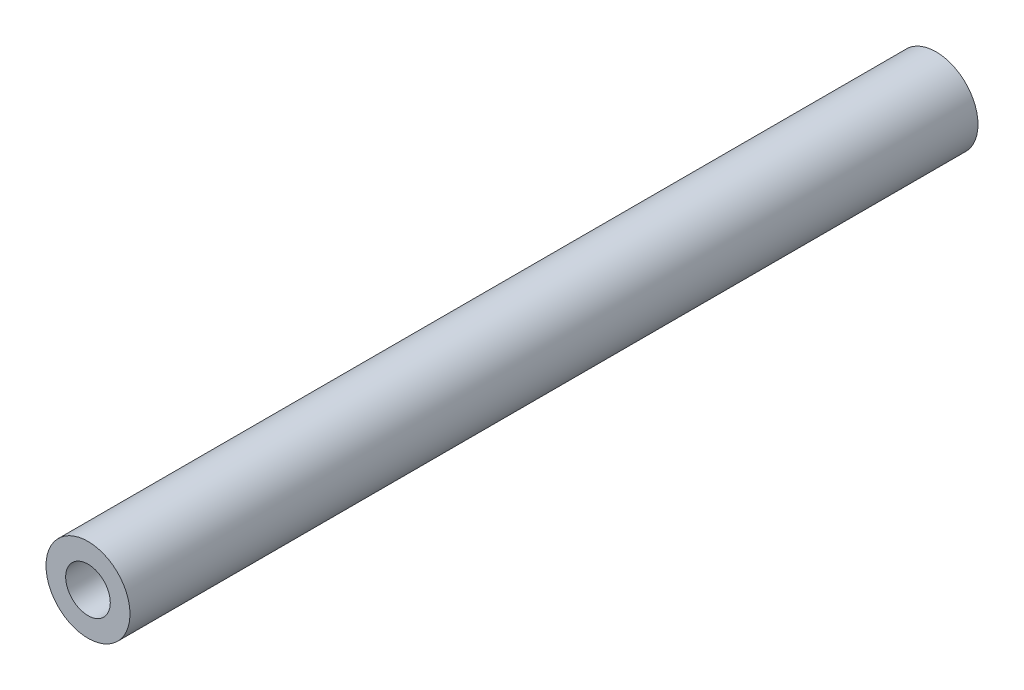
ISO-10303-21;
HEADER;
FILE_DESCRIPTION(('STEP AP214'),'2;1');
FILE_NAME('part.step','',(''),(''),'','','');
FILE_SCHEMA(('AUTOMOTIVE_DESIGN { 1 0 10303 214 1 1 1 1 }'));
ENDSEC;
DATA;
#1=APPLICATION_CONTEXT('core data for automotive mechanical design processes');
#2=APPLICATION_PROTOCOL_DEFINITION('international standard','automotive_design',2000,#1);
#3=PRODUCT_CONTEXT('',#1,'mechanical');
#4=PRODUCT('Part','Part','',(#3));
#5=PRODUCT_RELATED_PRODUCT_CATEGORY('part','',(#4));
#6=PRODUCT_DEFINITION_FORMATION('','',#4);
#7=PRODUCT_DEFINITION_CONTEXT('part definition',#1,'design');
#8=PRODUCT_DEFINITION('design','',#6,#7);
#9=PRODUCT_DEFINITION_SHAPE('','',#8);
#10=(LENGTH_UNIT() NAMED_UNIT(*) SI_UNIT(.MILLI.,.METRE.));
#11=(NAMED_UNIT(*) PLANE_ANGLE_UNIT() SI_UNIT($,.RADIAN.));
#12=(NAMED_UNIT(*) SI_UNIT($,.STERADIAN.) SOLID_ANGLE_UNIT());
#13=UNCERTAINTY_MEASURE_WITH_UNIT(LENGTH_MEASURE(1.E-05),#10,'distance_accuracy_value','');
#14=(GEOMETRIC_REPRESENTATION_CONTEXT(3) GLOBAL_UNCERTAINTY_ASSIGNED_CONTEXT((#13)) GLOBAL_UNIT_ASSIGNED_CONTEXT((#10,
#11,#12)) REPRESENTATION_CONTEXT('',''));
#15=CARTESIAN_POINT('',(0.,0.,0.));
#16=DIRECTION('',(0.,0.,1.));
#17=DIRECTION('',(1.,0.,0.));
#18=AXIS2_PLACEMENT_3D('',#15,#16,#17);
#19=CARTESIAN_POINT('',(99.9999999999999,-317.,0.));
#20=DIRECTION('',(0.,0.,1.));
#21=DIRECTION('',(1.,0.,0.));
#22=AXIS2_PLACEMENT_3D('',#19,#20,#21);
#23=PLANE('',#22);
#24=CARTESIAN_POINT('',(99.9999999999999,-317.,0.));
#25=DIRECTION('',(0.,0.,-1.));
#26=DIRECTION('',(-1.,0.,0.));
#27=AXIS2_PLACEMENT_3D('',#24,#25,#26);
#28=CIRCLE('',#27,4.24999999999999);
#29=CARTESIAN_POINT('',(95.7499999999999,-317.,0.));
#30=VERTEX_POINT('',#29);
#31=EDGE_CURVE('E63',#30,#30,#28,.T.);
#32=ORIENTED_EDGE('',*,*,#31,.F.);
#33=EDGE_LOOP('',(#32));
#34=FACE_BOUND('',#33,.T.);
#35=CARTESIAN_POINT('',(99.9999999999999,-317.,0.));
#36=DIRECTION('',(0.,0.,1.));
#37=DIRECTION('',(1.,0.,0.));
#38=AXIS2_PLACEMENT_3D('',#35,#36,#37);
#39=CIRCLE('',#38,8.);
#40=CARTESIAN_POINT('',(108.,-317.,0.));
#41=VERTEX_POINT('',#40);
#42=EDGE_CURVE('E46',#41,#41,#39,.T.);
#43=ORIENTED_EDGE('',*,*,#42,.F.);
#44=EDGE_LOOP('',(#43));
#45=FACE_BOUND('',#44,.T.);
#46=ADVANCED_FACE('F38',(#34,#45),#23,.F.);
#47=CARTESIAN_POINT('',(99.9999999999999,-317.,184.227416997969));
#48=DIRECTION('',(0.,0.,-1.));
#49=DIRECTION('',(-1.,0.,0.));
#50=AXIS2_PLACEMENT_3D('',#47,#48,#49);
#51=CYLINDRICAL_SURFACE('',#50,8.);
#52=CARTESIAN_POINT('',(99.9999999999999,-317.,161.6));
#53=DIRECTION('',(0.,0.,-1.));
#54=DIRECTION('',(-1.,0.,0.));
#55=AXIS2_PLACEMENT_3D('',#52,#53,#54);
#56=CIRCLE('',#55,8.);
#57=CARTESIAN_POINT('',(91.9999999999999,-317.,161.6));
#58=VERTEX_POINT('',#57);
#59=EDGE_CURVE('E11',#58,#58,#56,.T.);
#60=ORIENTED_EDGE('',*,*,#59,.T.);
#61=EDGE_LOOP('',(#60));
#62=FACE_BOUND('',#61,.T.);
#63=ORIENTED_EDGE('',*,*,#42,.T.);
#64=EDGE_LOOP('',(#63));
#65=FACE_BOUND('',#64,.T.);
#66=ADVANCED_FACE('F40',(#62,#65),#51,.T.);
#67=CARTESIAN_POINT('',(0.,0.,161.6));
#68=DIRECTION('',(0.,0.,-1.));
#69=DIRECTION('',(-1.,0.,0.));
#70=AXIS2_PLACEMENT_3D('',#67,#68,#69);
#71=PLANE('',#70);
#72=CARTESIAN_POINT('',(99.9999999999999,-317.,161.6));
#73=DIRECTION('',(0.,0.,1.));
#74=DIRECTION('',(1.,0.,0.));
#75=AXIS2_PLACEMENT_3D('',#72,#73,#74);
#76=CIRCLE('',#75,4.24999999999999);
#77=CARTESIAN_POINT('',(104.25,-317.,161.6));
#78=VERTEX_POINT('',#77);
#79=EDGE_CURVE('E62',#78,#78,#76,.T.);
#80=ORIENTED_EDGE('',*,*,#79,.F.);
#81=EDGE_LOOP('',(#80));
#82=FACE_BOUND('',#81,.T.);
#83=ORIENTED_EDGE('',*,*,#59,.F.);
#84=EDGE_LOOP('',(#83));
#85=FACE_BOUND('',#84,.T.);
#86=ADVANCED_FACE('F81',(#82,#85),#71,.F.);
#87=CARTESIAN_POINT('',(99.9999999999999,-317.,126.6));
#88=DIRECTION('',(0.,0.,1.));
#89=DIRECTION('',(1.,0.,0.));
#90=AXIS2_PLACEMENT_3D('',#87,#88,#89);
#91=CONICAL_SURFACE('',#90,4.24999999999999,1.02974425867665);
#92=CARTESIAN_POINT('',(99.9999999999999,-317.,124.046342369133));
#93=VERTEX_POINT('',#92);
#94=VERTEX_LOOP('',#93);
#95=FACE_BOUND('',#94,.T.);
#96=CARTESIAN_POINT('',(99.9999999999999,-317.,126.6));
#97=DIRECTION('',(0.,0.,1.));
#98=DIRECTION('',(1.,0.,0.));
#99=AXIS2_PLACEMENT_3D('',#96,#97,#98);
#100=CIRCLE('',#99,4.24999999999999);
#101=CARTESIAN_POINT('',(104.25,-317.,126.6));
#102=VERTEX_POINT('',#101);
#103=EDGE_CURVE('E66',#102,#102,#100,.T.);
#104=ORIENTED_EDGE('',*,*,#103,.T.);
#105=EDGE_LOOP('',(#104));
#106=FACE_BOUND('',#105,.T.);
#107=ADVANCED_FACE('F87',(#95,#106),#91,.F.);
#108=CARTESIAN_POINT('',(99.9999999999999,-317.,161.6));
#109=DIRECTION('',(0.,0.,1.));
#110=DIRECTION('',(1.,0.,0.));
#111=AXIS2_PLACEMENT_3D('',#108,#109,#110);
#112=CYLINDRICAL_SURFACE('',#111,4.24999999999999);
#113=ORIENTED_EDGE('',*,*,#103,.F.);
#114=EDGE_LOOP('',(#113));
#115=FACE_BOUND('',#114,.T.);
#116=ORIENTED_EDGE('',*,*,#79,.T.);
#117=EDGE_LOOP('',(#116));
#118=FACE_BOUND('',#117,.T.);
#119=ADVANCED_FACE('F56',(#115,#118),#112,.F.);
#120=CARTESIAN_POINT('',(99.9999999999999,-317.,35.));
#121=DIRECTION('',(0.,0.,-1.));
#122=DIRECTION('',(-1.,0.,0.));
#123=AXIS2_PLACEMENT_3D('',#120,#121,#122);
#124=CONICAL_SURFACE('',#123,4.24999999999999,1.02974425867665);
#125=CARTESIAN_POINT('',(99.9999999999999,-317.,37.5536576308671));
#126=VERTEX_POINT('',#125);
#127=VERTEX_LOOP('',#126);
#128=FACE_BOUND('',#127,.T.);
#129=CARTESIAN_POINT('',(99.9999999999999,-317.,35.));
#130=DIRECTION('',(0.,0.,-1.));
#131=DIRECTION('',(-1.,0.,0.));
#132=AXIS2_PLACEMENT_3D('',#129,#130,#131);
#133=CIRCLE('',#132,4.24999999999999);
#134=CARTESIAN_POINT('',(95.7499999999999,-317.,35.));
#135=VERTEX_POINT('',#134);
#136=EDGE_CURVE('E60',#135,#135,#133,.T.);
#137=ORIENTED_EDGE('',*,*,#136,.T.);
#138=EDGE_LOOP('',(#137));
#139=FACE_BOUND('',#138,.T.);
#140=ADVANCED_FACE('F52',(#128,#139),#124,.F.);
#141=CARTESIAN_POINT('',(99.9999999999999,-317.,0.));
#142=DIRECTION('',(0.,0.,-1.));
#143=DIRECTION('',(-1.,0.,0.));
#144=AXIS2_PLACEMENT_3D('',#141,#142,#143);
#145=CYLINDRICAL_SURFACE('',#144,4.24999999999999);
#146=ORIENTED_EDGE('',*,*,#136,.F.);
#147=EDGE_LOOP('',(#146));
#148=FACE_BOUND('',#147,.T.);
#149=ORIENTED_EDGE('',*,*,#31,.T.);
#150=EDGE_LOOP('',(#149));
#151=FACE_BOUND('',#150,.T.);
#152=ADVANCED_FACE('F55',(#148,#151),#145,.F.);
#153=CLOSED_SHELL('',(#46,#66,#86,#107,#119,#140,#152));
#154=MANIFOLD_SOLID_BREP('B2',#153);
#155=ADVANCED_BREP_SHAPE_REPRESENTATION('',(#18,#154),#14);
#156=SHAPE_DEFINITION_REPRESENTATION(#9,#155);
ENDSEC;
END-ISO-10303-21;
